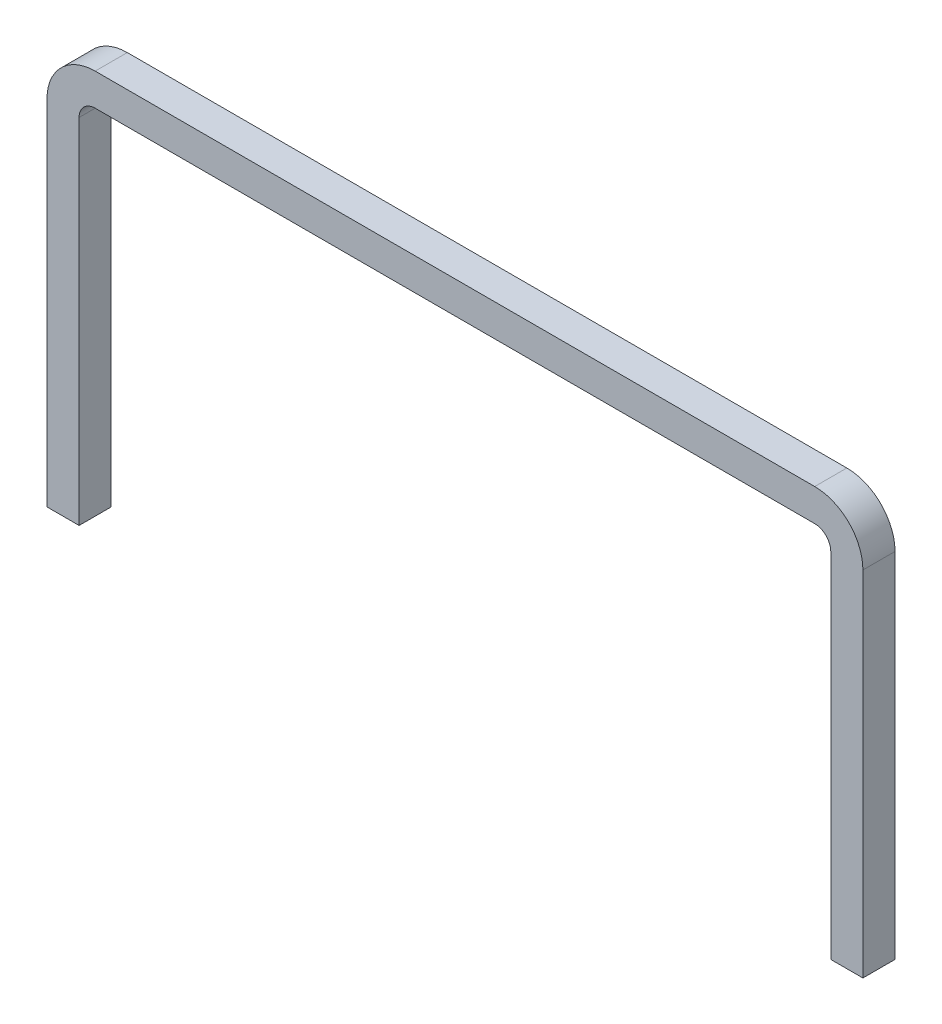
ISO-10303-21;
HEADER;
FILE_DESCRIPTION(('STEP AP214'),'2;1');
FILE_NAME('part.step','',(''),(''),'','','');
FILE_SCHEMA(('AUTOMOTIVE_DESIGN { 1 0 10303 214 1 1 1 1 }'));
ENDSEC;
DATA;
#1=APPLICATION_CONTEXT('core data for automotive mechanical design processes');
#2=APPLICATION_PROTOCOL_DEFINITION('international standard','automotive_design',2000,#1);
#3=PRODUCT_CONTEXT('',#1,'mechanical');
#4=PRODUCT('Part','Part','',(#3));
#5=PRODUCT_RELATED_PRODUCT_CATEGORY('part','',(#4));
#6=PRODUCT_DEFINITION_FORMATION('','',#4);
#7=PRODUCT_DEFINITION_CONTEXT('part definition',#1,'design');
#8=PRODUCT_DEFINITION('design','',#6,#7);
#9=PRODUCT_DEFINITION_SHAPE('','',#8);
#10=(LENGTH_UNIT() NAMED_UNIT(*) SI_UNIT(.MILLI.,.METRE.));
#11=(NAMED_UNIT(*) PLANE_ANGLE_UNIT() SI_UNIT($,.RADIAN.));
#12=(NAMED_UNIT(*) SI_UNIT($,.STERADIAN.) SOLID_ANGLE_UNIT());
#13=UNCERTAINTY_MEASURE_WITH_UNIT(LENGTH_MEASURE(1.E-05),#10,'distance_accuracy_value','');
#14=(GEOMETRIC_REPRESENTATION_CONTEXT(3) GLOBAL_UNCERTAINTY_ASSIGNED_CONTEXT((#13)) GLOBAL_UNIT_ASSIGNED_CONTEXT((#10,
#11,#12)) REPRESENTATION_CONTEXT('',''));
#15=CARTESIAN_POINT('',(0.,0.,0.));
#16=DIRECTION('',(0.,0.,1.));
#17=DIRECTION('',(1.,0.,0.));
#18=AXIS2_PLACEMENT_3D('',#15,#16,#17);
#19=CARTESIAN_POINT('',(-6.35,0.,0.25));
#20=DIRECTION('',(1.,0.,0.));
#21=DIRECTION('',(0.,1.,0.));
#22=AXIS2_PLACEMENT_3D('',#19,#20,#21);
#23=PLANE('',#22);
#24=DIRECTION('',(0.,-1.,0.));
#25=VECTOR('',#24,1.);
#26=CARTESIAN_POINT('',(-6.35,0.,-0.25));
#27=LINE('',#26,#25);
#28=CARTESIAN_POINT('',(-6.35,0.,-0.25));
#29=VERTEX_POINT('',#28);
#30=CARTESIAN_POINT('',(-6.35,-5.5,-0.25));
#31=VERTEX_POINT('',#30);
#32=EDGE_CURVE('E152',#29,#31,#27,.T.);
#33=ORIENTED_EDGE('',*,*,#32,.T.);
#34=DIRECTION('',(0.,0.,-1.));
#35=VECTOR('',#34,1.);
#36=CARTESIAN_POINT('',(-6.35,-5.5,0.25));
#37=LINE('',#36,#35);
#38=CARTESIAN_POINT('',(-6.35,-5.5,0.25));
#39=VERTEX_POINT('',#38);
#40=EDGE_CURVE('E11',#39,#31,#37,.T.);
#41=ORIENTED_EDGE('',*,*,#40,.F.);
#42=DIRECTION('',(0.,-1.,0.));
#43=VECTOR('',#42,1.);
#44=CARTESIAN_POINT('',(-6.35,0.,0.25));
#45=LINE('',#44,#43);
#46=CARTESIAN_POINT('',(-6.35,0.,0.25));
#47=VERTEX_POINT('',#46);
#48=EDGE_CURVE('E100',#47,#39,#45,.T.);
#49=ORIENTED_EDGE('',*,*,#48,.F.);
#50=DIRECTION('',(0.,0.,-1.));
#51=VECTOR('',#50,1.);
#52=CARTESIAN_POINT('',(-6.35,0.,0.25));
#53=LINE('',#52,#51);
#54=EDGE_CURVE('E148',#47,#29,#53,.T.);
#55=ORIENTED_EDGE('',*,*,#54,.T.);
#56=EDGE_LOOP('',(#33,#41,#49,#55));
#57=FACE_BOUND('',#56,.T.);
#58=ADVANCED_FACE('F32',(#57),#23,.F.);
#59=CARTESIAN_POINT('',(-5.85,-5.5,0.25));
#60=DIRECTION('',(0.,-1.,0.));
#61=DIRECTION('',(0.,0.,-1.));
#62=AXIS2_PLACEMENT_3D('',#59,#60,#61);
#63=PLANE('',#62);
#64=DIRECTION('',(-1.,0.,0.));
#65=VECTOR('',#64,1.);
#66=CARTESIAN_POINT('',(-5.85,-5.5,-0.25));
#67=LINE('',#66,#65);
#68=CARTESIAN_POINT('',(-5.85,-5.5,-0.25));
#69=VERTEX_POINT('',#68);
#70=EDGE_CURVE('E155',#69,#31,#67,.T.);
#71=ORIENTED_EDGE('',*,*,#70,.F.);
#72=DIRECTION('',(0.,0.,-1.));
#73=VECTOR('',#72,1.);
#74=CARTESIAN_POINT('',(-5.85,-5.5,0.25));
#75=LINE('',#74,#73);
#76=CARTESIAN_POINT('',(-5.85,-5.5,0.25));
#77=VERTEX_POINT('',#76);
#78=EDGE_CURVE('E40',#77,#69,#75,.T.);
#79=ORIENTED_EDGE('',*,*,#78,.F.);
#80=DIRECTION('',(-1.,0.,0.));
#81=VECTOR('',#80,1.);
#82=CARTESIAN_POINT('',(-5.85,-5.5,0.25));
#83=LINE('',#82,#81);
#84=EDGE_CURVE('E217',#77,#39,#83,.T.);
#85=ORIENTED_EDGE('',*,*,#84,.T.);
#86=ORIENTED_EDGE('',*,*,#40,.T.);
#87=EDGE_LOOP('',(#71,#79,#85,#86));
#88=FACE_BOUND('',#87,.T.);
#89=ADVANCED_FACE('F204',(#88),#63,.T.);
#90=CARTESIAN_POINT('',(-5.85,0.,0.25));
#91=DIRECTION('',(1.,0.,0.));
#92=DIRECTION('',(0.,1.,0.));
#93=AXIS2_PLACEMENT_3D('',#90,#91,#92);
#94=PLANE('',#93);
#95=DIRECTION('',(0.,-1.,0.));
#96=VECTOR('',#95,1.);
#97=CARTESIAN_POINT('',(-5.85,0.,-0.25));
#98=LINE('',#97,#96);
#99=CARTESIAN_POINT('',(-5.85,0.,-0.25));
#100=VERTEX_POINT('',#99);
#101=EDGE_CURVE('E158',#100,#69,#98,.T.);
#102=ORIENTED_EDGE('',*,*,#101,.F.);
#103=DIRECTION('',(0.,0.,-1.));
#104=VECTOR('',#103,1.);
#105=CARTESIAN_POINT('',(-5.85,0.,0.25));
#106=LINE('',#105,#104);
#107=CARTESIAN_POINT('',(-5.85,0.,0.25));
#108=VERTEX_POINT('',#107);
#109=EDGE_CURVE('E194',#108,#100,#106,.T.);
#110=ORIENTED_EDGE('',*,*,#109,.F.);
#111=DIRECTION('',(0.,-1.,0.));
#112=VECTOR('',#111,1.);
#113=CARTESIAN_POINT('',(-5.85,0.,0.25));
#114=LINE('',#113,#112);
#115=EDGE_CURVE('E201',#108,#77,#114,.T.);
#116=ORIENTED_EDGE('',*,*,#115,.T.);
#117=ORIENTED_EDGE('',*,*,#78,.T.);
#118=EDGE_LOOP('',(#102,#110,#116,#117));
#119=FACE_BOUND('',#118,.T.);
#120=ADVANCED_FACE('F199',(#119),#94,.T.);
#121=CARTESIAN_POINT('',(-5.6,0.,0.25));
#122=DIRECTION('',(0.,0.,-1.));
#123=DIRECTION('',(-1.,0.,0.));
#124=AXIS2_PLACEMENT_3D('',#121,#122,#123);
#125=CYLINDRICAL_SURFACE('',#124,0.25);
#126=CARTESIAN_POINT('',(-5.6,0.,-0.25));
#127=DIRECTION('',(0.,0.,1.));
#128=DIRECTION('',(1.,0.,0.));
#129=AXIS2_PLACEMENT_3D('',#126,#127,#128);
#130=CIRCLE('',#129,0.25);
#131=CARTESIAN_POINT('',(-5.6,0.25,-0.25));
#132=VERTEX_POINT('',#131);
#133=EDGE_CURVE('E161',#132,#100,#130,.T.);
#134=ORIENTED_EDGE('',*,*,#133,.F.);
#135=DIRECTION('',(0.,0.,-1.));
#136=VECTOR('',#135,1.);
#137=CARTESIAN_POINT('',(-5.6,0.25,0.25));
#138=LINE('',#137,#136);
#139=CARTESIAN_POINT('',(-5.6,0.25,0.25));
#140=VERTEX_POINT('',#139);
#141=EDGE_CURVE('E192',#140,#132,#138,.T.);
#142=ORIENTED_EDGE('',*,*,#141,.F.);
#143=CARTESIAN_POINT('',(-5.6,0.,0.25));
#144=DIRECTION('',(0.,0.,1.));
#145=DIRECTION('',(1.,0.,0.));
#146=AXIS2_PLACEMENT_3D('',#143,#144,#145);
#147=CIRCLE('',#146,0.25);
#148=EDGE_CURVE('E214',#140,#108,#147,.T.);
#149=ORIENTED_EDGE('',*,*,#148,.T.);
#150=ORIENTED_EDGE('',*,*,#109,.T.);
#151=EDGE_LOOP('',(#134,#142,#149,#150));
#152=FACE_BOUND('',#151,.T.);
#153=ADVANCED_FACE('F211',(#152),#125,.F.);
#154=CARTESIAN_POINT('',(-5.6,0.25,0.25));
#155=DIRECTION('',(0.,-1.,0.));
#156=DIRECTION('',(0.,0.,-1.));
#157=AXIS2_PLACEMENT_3D('',#154,#155,#156);
#158=PLANE('',#157);
#159=DIRECTION('',(1.,0.,0.));
#160=VECTOR('',#159,1.);
#161=CARTESIAN_POINT('',(-5.6,0.25,-0.25));
#162=LINE('',#161,#160);
#163=CARTESIAN_POINT('',(5.6,0.25,-0.25));
#164=VERTEX_POINT('',#163);
#165=EDGE_CURVE('E164',#164,#132,#162,.F.);
#166=ORIENTED_EDGE('',*,*,#165,.F.);
#167=DIRECTION('',(0.,0.,-1.));
#168=VECTOR('',#167,1.);
#169=CARTESIAN_POINT('',(5.6,0.25,0.25));
#170=LINE('',#169,#168);
#171=CARTESIAN_POINT('',(5.6,0.25,0.25));
#172=VERTEX_POINT('',#171);
#173=EDGE_CURVE('E190',#172,#164,#170,.T.);
#174=ORIENTED_EDGE('',*,*,#173,.F.);
#175=DIRECTION('',(1.,0.,0.));
#176=VECTOR('',#175,1.);
#177=CARTESIAN_POINT('',(-5.6,0.25,0.25));
#178=LINE('',#177,#176);
#179=EDGE_CURVE('E219',#172,#140,#178,.F.);
#180=ORIENTED_EDGE('',*,*,#179,.T.);
#181=ORIENTED_EDGE('',*,*,#141,.T.);
#182=EDGE_LOOP('',(#166,#174,#180,#181));
#183=FACE_BOUND('',#182,.T.);
#184=ADVANCED_FACE('F319',(#183),#158,.T.);
#185=CARTESIAN_POINT('',(5.6,0.,0.25));
#186=DIRECTION('',(0.,0.,-1.));
#187=DIRECTION('',(-1.,0.,0.));
#188=AXIS2_PLACEMENT_3D('',#185,#186,#187);
#189=CYLINDRICAL_SURFACE('',#188,0.25);
#190=CARTESIAN_POINT('',(5.6,0.,-0.25));
#191=DIRECTION('',(0.,0.,1.));
#192=DIRECTION('',(1.,0.,0.));
#193=AXIS2_PLACEMENT_3D('',#190,#191,#192);
#194=CIRCLE('',#193,0.25);
#195=CARTESIAN_POINT('',(5.85,0.,-0.25));
#196=VERTEX_POINT('',#195);
#197=EDGE_CURVE('E167',#196,#164,#194,.T.);
#198=ORIENTED_EDGE('',*,*,#197,.F.);
#199=DIRECTION('',(0.,0.,-1.));
#200=VECTOR('',#199,1.);
#201=CARTESIAN_POINT('',(5.85,0.,0.25));
#202=LINE('',#201,#200);
#203=CARTESIAN_POINT('',(5.85,0.,0.25));
#204=VERTEX_POINT('',#203);
#205=EDGE_CURVE('E188',#204,#196,#202,.T.);
#206=ORIENTED_EDGE('',*,*,#205,.F.);
#207=CARTESIAN_POINT('',(5.6,0.,0.25));
#208=DIRECTION('',(0.,0.,1.));
#209=DIRECTION('',(1.,0.,0.));
#210=AXIS2_PLACEMENT_3D('',#207,#208,#209);
#211=CIRCLE('',#210,0.25);
#212=EDGE_CURVE('E225',#204,#172,#211,.T.);
#213=ORIENTED_EDGE('',*,*,#212,.T.);
#214=ORIENTED_EDGE('',*,*,#173,.T.);
#215=EDGE_LOOP('',(#198,#206,#213,#214));
#216=FACE_BOUND('',#215,.T.);
#217=ADVANCED_FACE('F310',(#216),#189,.F.);
#218=CARTESIAN_POINT('',(5.85,0.,0.25));
#219=DIRECTION('',(-1.,0.,0.));
#220=DIRECTION('',(0.,-1.,0.));
#221=AXIS2_PLACEMENT_3D('',#218,#219,#220);
#222=PLANE('',#221);
#223=DIRECTION('',(0.,1.,0.));
#224=VECTOR('',#223,1.);
#225=CARTESIAN_POINT('',(5.85,0.,-0.25));
#226=LINE('',#225,#224);
#227=CARTESIAN_POINT('',(5.85,-5.5,-0.25));
#228=VERTEX_POINT('',#227);
#229=EDGE_CURVE('E170',#228,#196,#226,.T.);
#230=ORIENTED_EDGE('',*,*,#229,.F.);
#231=DIRECTION('',(0.,0.,-1.));
#232=VECTOR('',#231,1.);
#233=CARTESIAN_POINT('',(5.85,-5.5,0.25));
#234=LINE('',#233,#232);
#235=CARTESIAN_POINT('',(5.85,-5.5,0.25));
#236=VERTEX_POINT('',#235);
#237=EDGE_CURVE('E186',#236,#228,#234,.T.);
#238=ORIENTED_EDGE('',*,*,#237,.F.);
#239=DIRECTION('',(0.,1.,0.));
#240=VECTOR('',#239,1.);
#241=CARTESIAN_POINT('',(5.85,0.,0.25));
#242=LINE('',#241,#240);
#243=EDGE_CURVE('E228',#236,#204,#242,.T.);
#244=ORIENTED_EDGE('',*,*,#243,.T.);
#245=ORIENTED_EDGE('',*,*,#205,.T.);
#246=EDGE_LOOP('',(#230,#238,#244,#245));
#247=FACE_BOUND('',#246,.T.);
#248=ADVANCED_FACE('F240',(#247),#222,.T.);
#249=CARTESIAN_POINT('',(6.35,-5.5,0.25));
#250=DIRECTION('',(0.,-1.,0.));
#251=DIRECTION('',(0.,0.,-1.));
#252=AXIS2_PLACEMENT_3D('',#249,#250,#251);
#253=PLANE('',#252);
#254=DIRECTION('',(-1.,0.,0.));
#255=VECTOR('',#254,1.);
#256=CARTESIAN_POINT('',(6.35,-5.5,-0.25));
#257=LINE('',#256,#255);
#258=CARTESIAN_POINT('',(6.35,-5.5,-0.25));
#259=VERTEX_POINT('',#258);
#260=EDGE_CURVE('E173',#259,#228,#257,.T.);
#261=ORIENTED_EDGE('',*,*,#260,.F.);
#262=DIRECTION('',(0.,0.,-1.));
#263=VECTOR('',#262,1.);
#264=CARTESIAN_POINT('',(6.35,-5.5,0.25));
#265=LINE('',#264,#263);
#266=CARTESIAN_POINT('',(6.35,-5.5,0.25));
#267=VERTEX_POINT('',#266);
#268=EDGE_CURVE('E184',#267,#259,#265,.T.);
#269=ORIENTED_EDGE('',*,*,#268,.F.);
#270=DIRECTION('',(-1.,0.,0.));
#271=VECTOR('',#270,1.);
#272=CARTESIAN_POINT('',(6.35,-5.5,0.25));
#273=LINE('',#272,#271);
#274=EDGE_CURVE('E231',#267,#236,#273,.T.);
#275=ORIENTED_EDGE('',*,*,#274,.T.);
#276=ORIENTED_EDGE('',*,*,#237,.T.);
#277=EDGE_LOOP('',(#261,#269,#275,#276));
#278=FACE_BOUND('',#277,.T.);
#279=ADVANCED_FACE('F235',(#278),#253,.T.);
#280=CARTESIAN_POINT('',(6.35,0.,0.25));
#281=DIRECTION('',(-1.,0.,0.));
#282=DIRECTION('',(0.,-1.,0.));
#283=AXIS2_PLACEMENT_3D('',#280,#281,#282);
#284=PLANE('',#283);
#285=DIRECTION('',(0.,1.,0.));
#286=VECTOR('',#285,1.);
#287=CARTESIAN_POINT('',(6.35,0.,-0.25));
#288=LINE('',#287,#286);
#289=CARTESIAN_POINT('',(6.35,0.,-0.25));
#290=VERTEX_POINT('',#289);
#291=EDGE_CURVE('E176',#259,#290,#288,.T.);
#292=ORIENTED_EDGE('',*,*,#291,.T.);
#293=DIRECTION('',(0.,0.,-1.));
#294=VECTOR('',#293,1.);
#295=CARTESIAN_POINT('',(6.35,0.,0.25));
#296=LINE('',#295,#294);
#297=CARTESIAN_POINT('',(6.35,0.,0.25));
#298=VERTEX_POINT('',#297);
#299=EDGE_CURVE('E143',#298,#290,#296,.T.);
#300=ORIENTED_EDGE('',*,*,#299,.F.);
#301=DIRECTION('',(0.,1.,0.));
#302=VECTOR('',#301,1.);
#303=CARTESIAN_POINT('',(6.35,0.,0.25));
#304=LINE('',#303,#302);
#305=EDGE_CURVE('E134',#267,#298,#304,.T.);
#306=ORIENTED_EDGE('',*,*,#305,.F.);
#307=ORIENTED_EDGE('',*,*,#268,.T.);
#308=EDGE_LOOP('',(#292,#300,#306,#307));
#309=FACE_BOUND('',#308,.T.);
#310=ADVANCED_FACE('F244',(#309),#284,.F.);
#311=CARTESIAN_POINT('',(5.6,0.,0.25));
#312=DIRECTION('',(0.,0.,-1.));
#313=DIRECTION('',(-1.,0.,0.));
#314=AXIS2_PLACEMENT_3D('',#311,#312,#313);
#315=CYLINDRICAL_SURFACE('',#314,0.75);
#316=CARTESIAN_POINT('',(5.6,0.,-0.25));
#317=DIRECTION('',(0.,0.,1.));
#318=DIRECTION('',(1.,0.,0.));
#319=AXIS2_PLACEMENT_3D('',#316,#317,#318);
#320=CIRCLE('',#319,0.75);
#321=CARTESIAN_POINT('',(5.6,0.75,-0.25));
#322=VERTEX_POINT('',#321);
#323=EDGE_CURVE('E142',#290,#322,#320,.T.);
#324=ORIENTED_EDGE('',*,*,#323,.T.);
#325=DIRECTION('',(0.,0.,-1.));
#326=VECTOR('',#325,1.);
#327=CARTESIAN_POINT('',(5.6,0.75,0.25));
#328=LINE('',#327,#326);
#329=CARTESIAN_POINT('',(5.6,0.75,0.25));
#330=VERTEX_POINT('',#329);
#331=EDGE_CURVE('E139',#330,#322,#328,.T.);
#332=ORIENTED_EDGE('',*,*,#331,.F.);
#333=CARTESIAN_POINT('',(5.6,0.,0.25));
#334=DIRECTION('',(0.,0.,1.));
#335=DIRECTION('',(1.,0.,0.));
#336=AXIS2_PLACEMENT_3D('',#333,#334,#335);
#337=CIRCLE('',#336,0.75);
#338=EDGE_CURVE('E127',#298,#330,#337,.T.);
#339=ORIENTED_EDGE('',*,*,#338,.F.);
#340=ORIENTED_EDGE('',*,*,#299,.T.);
#341=EDGE_LOOP('',(#324,#332,#339,#340));
#342=FACE_BOUND('',#341,.T.);
#343=ADVANCED_FACE('F140',(#342),#315,.T.);
#344=CARTESIAN_POINT('',(-5.6,0.75,0.25));
#345=DIRECTION('',(0.,-1.,0.));
#346=DIRECTION('',(0.,0.,-1.));
#347=AXIS2_PLACEMENT_3D('',#344,#345,#346);
#348=PLANE('',#347);
#349=DIRECTION('',(1.,0.,0.));
#350=VECTOR('',#349,1.);
#351=CARTESIAN_POINT('',(-5.6,0.75,-0.25));
#352=LINE('',#351,#350);
#353=CARTESIAN_POINT('',(-5.6,0.75,-0.25));
#354=VERTEX_POINT('',#353);
#355=EDGE_CURVE('E88',#322,#354,#352,.F.);
#356=ORIENTED_EDGE('',*,*,#355,.T.);
#357=DIRECTION('',(0.,0.,-1.));
#358=VECTOR('',#357,1.);
#359=CARTESIAN_POINT('',(-5.6,0.75,0.25));
#360=LINE('',#359,#358);
#361=CARTESIAN_POINT('',(-5.6,0.75,0.25));
#362=VERTEX_POINT('',#361);
#363=EDGE_CURVE('E144',#362,#354,#360,.T.);
#364=ORIENTED_EDGE('',*,*,#363,.F.);
#365=DIRECTION('',(1.,0.,0.));
#366=VECTOR('',#365,1.);
#367=CARTESIAN_POINT('',(-5.6,0.75,0.25));
#368=LINE('',#367,#366);
#369=EDGE_CURVE('E131',#330,#362,#368,.F.);
#370=ORIENTED_EDGE('',*,*,#369,.F.);
#371=ORIENTED_EDGE('',*,*,#331,.T.);
#372=EDGE_LOOP('',(#356,#364,#370,#371));
#373=FACE_BOUND('',#372,.T.);
#374=ADVANCED_FACE('F146',(#373),#348,.F.);
#375=CARTESIAN_POINT('',(-5.6,0.,0.25));
#376=DIRECTION('',(0.,0.,-1.));
#377=DIRECTION('',(-1.,0.,0.));
#378=AXIS2_PLACEMENT_3D('',#375,#376,#377);
#379=CYLINDRICAL_SURFACE('',#378,0.75);
#380=CARTESIAN_POINT('',(-5.6,0.,-0.25));
#381=DIRECTION('',(0.,0.,1.));
#382=DIRECTION('',(1.,0.,0.));
#383=AXIS2_PLACEMENT_3D('',#380,#381,#382);
#384=CIRCLE('',#383,0.75);
#385=EDGE_CURVE('E94',#354,#29,#384,.T.);
#386=ORIENTED_EDGE('',*,*,#385,.T.);
#387=ORIENTED_EDGE('',*,*,#54,.F.);
#388=CARTESIAN_POINT('',(-5.6,0.,0.25));
#389=DIRECTION('',(0.,0.,1.));
#390=DIRECTION('',(1.,0.,0.));
#391=AXIS2_PLACEMENT_3D('',#388,#389,#390);
#392=CIRCLE('',#391,0.75);
#393=EDGE_CURVE('E48',#362,#47,#392,.T.);
#394=ORIENTED_EDGE('',*,*,#393,.F.);
#395=ORIENTED_EDGE('',*,*,#363,.T.);
#396=EDGE_LOOP('',(#386,#387,#394,#395));
#397=FACE_BOUND('',#396,.T.);
#398=ADVANCED_FACE('F258',(#397),#379,.T.);
#399=CARTESIAN_POINT('',(-5.6,0.,0.25));
#400=DIRECTION('',(0.,0.,1.));
#401=DIRECTION('',(1.,0.,0.));
#402=AXIS2_PLACEMENT_3D('',#399,#400,#401);
#403=PLANE('',#402);
#404=ORIENTED_EDGE('',*,*,#48,.T.);
#405=ORIENTED_EDGE('',*,*,#84,.F.);
#406=ORIENTED_EDGE('',*,*,#115,.F.);
#407=ORIENTED_EDGE('',*,*,#148,.F.);
#408=ORIENTED_EDGE('',*,*,#179,.F.);
#409=ORIENTED_EDGE('',*,*,#212,.F.);
#410=ORIENTED_EDGE('',*,*,#243,.F.);
#411=ORIENTED_EDGE('',*,*,#274,.F.);
#412=ORIENTED_EDGE('',*,*,#305,.T.);
#413=ORIENTED_EDGE('',*,*,#338,.T.);
#414=ORIENTED_EDGE('',*,*,#369,.T.);
#415=ORIENTED_EDGE('',*,*,#393,.T.);
#416=EDGE_LOOP('',(#404,#405,#406,#407,#408,#409,#410,#411,#412,#413,#414,#415));
#417=FACE_BOUND('',#416,.T.);
#418=ADVANCED_FACE('F129',(#417),#403,.T.);
#419=CARTESIAN_POINT('',(-5.6,0.,-0.25));
#420=DIRECTION('',(0.,0.,1.));
#421=DIRECTION('',(1.,0.,0.));
#422=AXIS2_PLACEMENT_3D('',#419,#420,#421);
#423=PLANE('',#422);
#424=ORIENTED_EDGE('',*,*,#32,.F.);
#425=ORIENTED_EDGE('',*,*,#385,.F.);
#426=ORIENTED_EDGE('',*,*,#355,.F.);
#427=ORIENTED_EDGE('',*,*,#323,.F.);
#428=ORIENTED_EDGE('',*,*,#291,.F.);
#429=ORIENTED_EDGE('',*,*,#260,.T.);
#430=ORIENTED_EDGE('',*,*,#229,.T.);
#431=ORIENTED_EDGE('',*,*,#197,.T.);
#432=ORIENTED_EDGE('',*,*,#165,.T.);
#433=ORIENTED_EDGE('',*,*,#133,.T.);
#434=ORIENTED_EDGE('',*,*,#101,.T.);
#435=ORIENTED_EDGE('',*,*,#70,.T.);
#436=EDGE_LOOP('',(#424,#425,#426,#427,#428,#429,#430,#431,#432,#433,#434,#435));
#437=FACE_BOUND('',#436,.T.);
#438=ADVANCED_FACE('F207',(#437),#423,.F.);
#439=CLOSED_SHELL('',(#58,#89,#120,#153,#184,#217,#248,#279,#310,#343,#374,#398,#418,#438));
#440=MANIFOLD_SOLID_BREP('B2',#439);
#441=ADVANCED_BREP_SHAPE_REPRESENTATION('',(#18,#440),#14);
#442=SHAPE_DEFINITION_REPRESENTATION(#9,#441);
ENDSEC;
END-ISO-10303-21;
